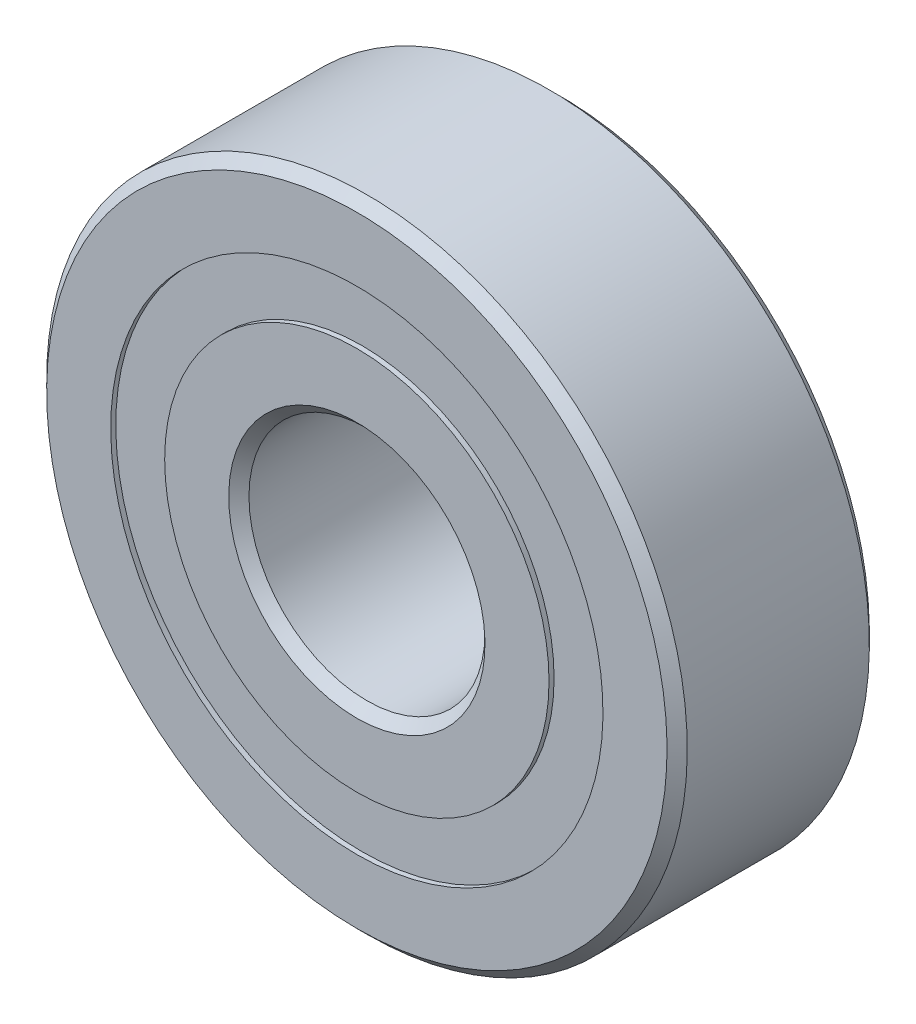
ISO-10303-21;
HEADER;
FILE_DESCRIPTION(('STEP AP214'),'2;1');
FILE_NAME('part.step','',(''),(''),'','','');
FILE_SCHEMA(('AUTOMOTIVE_DESIGN { 1 0 10303 214 1 1 1 1 }'));
ENDSEC;
DATA;
#1=APPLICATION_CONTEXT('core data for automotive mechanical design processes');
#2=APPLICATION_PROTOCOL_DEFINITION('international standard','automotive_design',2000,#1);
#3=PRODUCT_CONTEXT('',#1,'mechanical');
#4=PRODUCT('Part','Part','',(#3));
#5=PRODUCT_RELATED_PRODUCT_CATEGORY('part','',(#4));
#6=PRODUCT_DEFINITION_FORMATION('','',#4);
#7=PRODUCT_DEFINITION_CONTEXT('part definition',#1,'design');
#8=PRODUCT_DEFINITION('design','',#6,#7);
#9=PRODUCT_DEFINITION_SHAPE('','',#8);
#10=(LENGTH_UNIT() NAMED_UNIT(*) SI_UNIT(.MILLI.,.METRE.));
#11=(NAMED_UNIT(*) PLANE_ANGLE_UNIT() SI_UNIT($,.RADIAN.));
#12=(NAMED_UNIT(*) SI_UNIT($,.STERADIAN.) SOLID_ANGLE_UNIT());
#13=UNCERTAINTY_MEASURE_WITH_UNIT(LENGTH_MEASURE(1.E-05),#10,'distance_accuracy_value','');
#14=(GEOMETRIC_REPRESENTATION_CONTEXT(3) GLOBAL_UNCERTAINTY_ASSIGNED_CONTEXT((#13)) GLOBAL_UNIT_ASSIGNED_CONTEXT((#10,
#11,#12)) REPRESENTATION_CONTEXT('',''));
#15=CARTESIAN_POINT('',(0.,0.,0.));
#16=DIRECTION('',(0.,0.,1.));
#17=DIRECTION('',(1.,0.,0.));
#18=AXIS2_PLACEMENT_3D('',#15,#16,#17);
#19=CARTESIAN_POINT('',(0.,7.3,-2.85));
#20=DIRECTION('',(0.,0.,1.));
#21=DIRECTION('',(0.,-1.,0.));
#22=AXIS2_PLACEMENT_3D('',#19,#20,#21);
#23=PLANE('',#22);
#24=CARTESIAN_POINT('',(0.,0.,-2.85));
#25=DIRECTION('',(0.,0.,1.));
#26=DIRECTION('',(0.,-1.,0.));
#27=AXIS2_PLACEMENT_3D('',#24,#25,#26);
#28=CIRCLE('',#27,7.3);
#29=CARTESIAN_POINT('',(0.,-7.3,-2.85));
#30=VERTEX_POINT('',#29);
#31=EDGE_CURVE('E55',#30,#30,#28,.T.);
#32=ORIENTED_EDGE('',*,*,#31,.F.);
#33=EDGE_LOOP('',(#32));
#34=FACE_BOUND('',#33,.T.);
#35=CARTESIAN_POINT('',(0.,0.,-2.85));
#36=DIRECTION('',(0.,0.,1.));
#37=DIRECTION('',(0.,-1.,0.));
#38=AXIS2_PLACEMENT_3D('',#35,#36,#37);
#39=CIRCLE('',#38,5.7);
#40=CARTESIAN_POINT('',(0.,-5.7,-2.85));
#41=VERTEX_POINT('',#40);
#42=EDGE_CURVE('E11',#41,#41,#39,.T.);
#43=ORIENTED_EDGE('',*,*,#42,.T.);
#44=EDGE_LOOP('',(#43));
#45=FACE_BOUND('',#44,.T.);
#46=ADVANCED_FACE('F41',(#34,#45),#23,.F.);
#47=CARTESIAN_POINT('',(0.,0.,3.));
#48=DIRECTION('',(0.,0.,1.));
#49=DIRECTION('',(0.,-1.,0.));
#50=AXIS2_PLACEMENT_3D('',#47,#48,#49);
#51=CYLINDRICAL_SURFACE('',#50,5.7);
#52=ORIENTED_EDGE('',*,*,#42,.F.);
#53=EDGE_LOOP('',(#52));
#54=FACE_BOUND('',#53,.T.);
#55=CARTESIAN_POINT('',(0.,0.,-1.55492050529208));
#56=DIRECTION('',(0.,0.,1.));
#57=DIRECTION('',(0.,-1.,0.));
#58=AXIS2_PLACEMENT_3D('',#55,#56,#57);
#59=CIRCLE('',#58,5.7);
#60=CARTESIAN_POINT('',(0.,-5.7,-1.55492050529208));
#61=VERTEX_POINT('',#60);
#62=EDGE_CURVE('E47',#61,#61,#59,.T.);
#63=ORIENTED_EDGE('',*,*,#62,.T.);
#64=EDGE_LOOP('',(#63));
#65=FACE_BOUND('',#64,.T.);
#66=ADVANCED_FACE('F64',(#54,#65),#51,.F.);
#67=CARTESIAN_POINT('',(0.,7.3,-1.55492050529208));
#68=DIRECTION('',(0.,0.,-1.));
#69=DIRECTION('',(0.,1.,0.));
#70=AXIS2_PLACEMENT_3D('',#67,#68,#69);
#71=PLANE('',#70);
#72=ORIENTED_EDGE('',*,*,#62,.F.);
#73=EDGE_LOOP('',(#72));
#74=FACE_BOUND('',#73,.T.);
#75=CARTESIAN_POINT('',(0.,0.,-1.55492050529208));
#76=DIRECTION('',(0.,0.,1.));
#77=DIRECTION('',(0.,-1.,0.));
#78=AXIS2_PLACEMENT_3D('',#75,#76,#77);
#79=CIRCLE('',#78,7.3);
#80=CARTESIAN_POINT('',(0.,-7.3,-1.55492050529208));
#81=VERTEX_POINT('',#80);
#82=EDGE_CURVE('E51',#81,#81,#79,.T.);
#83=ORIENTED_EDGE('',*,*,#82,.T.);
#84=EDGE_LOOP('',(#83));
#85=FACE_BOUND('',#84,.T.);
#86=ADVANCED_FACE('F68',(#74,#85),#71,.F.);
#87=CARTESIAN_POINT('',(0.,0.,3.));
#88=DIRECTION('',(0.,0.,1.));
#89=DIRECTION('',(0.,-1.,0.));
#90=AXIS2_PLACEMENT_3D('',#87,#88,#89);
#91=CYLINDRICAL_SURFACE('',#90,7.3);
#92=ORIENTED_EDGE('',*,*,#82,.F.);
#93=EDGE_LOOP('',(#92));
#94=FACE_BOUND('',#93,.T.);
#95=ORIENTED_EDGE('',*,*,#31,.T.);
#96=EDGE_LOOP('',(#95));
#97=FACE_BOUND('',#96,.T.);
#98=ADVANCED_FACE('F61',(#94,#97),#91,.T.);
#99=CLOSED_SHELL('',(#46,#66,#86,#98));
#100=MANIFOLD_SOLID_BREP('B2',#99);
#101=CARTESIAN_POINT('',(0.,7.3,2.85));
#102=DIRECTION('',(0.,0.,-1.));
#103=DIRECTION('',(0.,1.,0.));
#104=AXIS2_PLACEMENT_3D('',#101,#102,#103);
#105=PLANE('',#104);
#106=CARTESIAN_POINT('',(0.,0.,2.85));
#107=DIRECTION('',(0.,0.,1.));
#108=DIRECTION('',(0.,-1.,0.));
#109=AXIS2_PLACEMENT_3D('',#106,#107,#108);
#110=CIRCLE('',#109,5.7);
#111=CARTESIAN_POINT('',(0.,-5.7,2.85));
#112=VERTEX_POINT('',#111);
#113=EDGE_CURVE('E40',#112,#112,#110,.T.);
#114=ORIENTED_EDGE('',*,*,#113,.F.);
#115=EDGE_LOOP('',(#114));
#116=FACE_BOUND('',#115,.T.);
#117=CARTESIAN_POINT('',(0.,0.,2.85));
#118=DIRECTION('',(0.,0.,1.));
#119=DIRECTION('',(0.,-1.,0.));
#120=AXIS2_PLACEMENT_3D('',#117,#118,#119);
#121=CIRCLE('',#120,7.3);
#122=CARTESIAN_POINT('',(0.,-7.3,2.85));
#123=VERTEX_POINT('',#122);
#124=EDGE_CURVE('E122',#123,#123,#121,.T.);
#125=ORIENTED_EDGE('',*,*,#124,.T.);
#126=EDGE_LOOP('',(#125));
#127=FACE_BOUND('',#126,.T.);
#128=ADVANCED_FACE('F108',(#116,#127),#105,.F.);
#129=CARTESIAN_POINT('',(0.,0.,3.));
#130=DIRECTION('',(0.,0.,1.));
#131=DIRECTION('',(0.,-1.,0.));
#132=AXIS2_PLACEMENT_3D('',#129,#130,#131);
#133=CYLINDRICAL_SURFACE('',#132,5.7);
#134=CARTESIAN_POINT('',(0.,0.,1.55492050529208));
#135=DIRECTION('',(0.,0.,1.));
#136=DIRECTION('',(0.,-1.,0.));
#137=AXIS2_PLACEMENT_3D('',#134,#135,#136);
#138=CIRCLE('',#137,5.7);
#139=CARTESIAN_POINT('',(0.,-5.7,1.55492050529208));
#140=VERTEX_POINT('',#139);
#141=EDGE_CURVE('E114',#140,#140,#138,.T.);
#142=ORIENTED_EDGE('',*,*,#141,.F.);
#143=EDGE_LOOP('',(#142));
#144=FACE_BOUND('',#143,.T.);
#145=ORIENTED_EDGE('',*,*,#113,.T.);
#146=EDGE_LOOP('',(#145));
#147=FACE_BOUND('',#146,.T.);
#148=ADVANCED_FACE('F137',(#144,#147),#133,.F.);
#149=CARTESIAN_POINT('',(0.,7.3,1.55492050529208));
#150=DIRECTION('',(0.,0.,1.));
#151=DIRECTION('',(0.,-1.,0.));
#152=AXIS2_PLACEMENT_3D('',#149,#150,#151);
#153=PLANE('',#152);
#154=CARTESIAN_POINT('',(0.,0.,1.55492050529208));
#155=DIRECTION('',(0.,0.,1.));
#156=DIRECTION('',(0.,-1.,0.));
#157=AXIS2_PLACEMENT_3D('',#154,#155,#156);
#158=CIRCLE('',#157,7.3);
#159=CARTESIAN_POINT('',(0.,-7.3,1.55492050529208));
#160=VERTEX_POINT('',#159);
#161=EDGE_CURVE('E118',#160,#160,#158,.T.);
#162=ORIENTED_EDGE('',*,*,#161,.F.);
#163=EDGE_LOOP('',(#162));
#164=FACE_BOUND('',#163,.T.);
#165=ORIENTED_EDGE('',*,*,#141,.T.);
#166=EDGE_LOOP('',(#165));
#167=FACE_BOUND('',#166,.T.);
#168=ADVANCED_FACE('F132',(#164,#167),#153,.F.);
#169=CARTESIAN_POINT('',(0.,0.,3.));
#170=DIRECTION('',(0.,0.,1.));
#171=DIRECTION('',(0.,-1.,0.));
#172=AXIS2_PLACEMENT_3D('',#169,#170,#171);
#173=CYLINDRICAL_SURFACE('',#172,7.3);
#174=ORIENTED_EDGE('',*,*,#124,.F.);
#175=EDGE_LOOP('',(#174));
#176=FACE_BOUND('',#175,.T.);
#177=ORIENTED_EDGE('',*,*,#161,.T.);
#178=EDGE_LOOP('',(#177));
#179=FACE_BOUND('',#178,.T.);
#180=ADVANCED_FACE('F129',(#176,#179),#173,.T.);
#181=CLOSED_SHELL('',(#128,#148,#168,#180));
#182=MANIFOLD_SOLID_BREP('B6',#181);
#183=CARTESIAN_POINT('',(-5.62916512459881,3.25000000000007,0.));
#184=DIRECTION('',(0.,0.,1.));
#185=DIRECTION('',(-0.866025403784433,0.50000000000001,0.));
#186=AXIS2_PLACEMENT_3D('',#183,#184,#185);
#187=SPHERICAL_SURFACE('',#186,1.55492050529208);
#188=CARTESIAN_POINT('',(-5.62916512459881,3.25000000000007,1.55492050529208));
#189=VERTEX_POINT('',#188);
#190=VERTEX_LOOP('',#189);
#191=FACE_BOUND('',#190,.T.);
#192=ADVANCED_FACE('F188',(#191),#187,.T.);
#193=CLOSED_SHELL('',(#192));
#194=MANIFOLD_SOLID_BREP('B35',#193);
#195=CARTESIAN_POINT('',(-5.62916512459888,-3.24999999999995,0.));
#196=DIRECTION('',(0.,0.,1.));
#197=DIRECTION('',(-0.866025403784443,-0.499999999999992,0.));
#198=AXIS2_PLACEMENT_3D('',#195,#196,#197);
#199=SPHERICAL_SURFACE('',#198,1.55492050529208);
#200=CARTESIAN_POINT('',(-5.62916512459888,-3.24999999999995,1.55492050529208));
#201=VERTEX_POINT('',#200);
#202=VERTEX_LOOP('',#201);
#203=FACE_BOUND('',#202,.T.);
#204=ADVANCED_FACE('F206',(#203),#199,.T.);
#205=CLOSED_SHELL('',(#204));
#206=MANIFOLD_SOLID_BREP('B104',#205);
#207=CARTESIAN_POINT('',(0.,-6.5,0.));
#208=DIRECTION('',(0.,0.,1.));
#209=DIRECTION('',(0.,-1.,0.));
#210=AXIS2_PLACEMENT_3D('',#207,#208,#209);
#211=SPHERICAL_SURFACE('',#210,1.55492050529208);
#212=CARTESIAN_POINT('',(0.,-6.5,1.55492050529208));
#213=VERTEX_POINT('',#212);
#214=VERTEX_LOOP('',#213);
#215=FACE_BOUND('',#214,.T.);
#216=ADVANCED_FACE('F224',(#215),#211,.T.);
#217=CLOSED_SHELL('',(#216));
#218=MANIFOLD_SOLID_BREP('B184',#217);
#219=CARTESIAN_POINT('',(5.62916512459884,-3.25000000000003,0.));
#220=DIRECTION('',(0.,0.,1.));
#221=DIRECTION('',(0.866025403784436,-0.500000000000004,0.));
#222=AXIS2_PLACEMENT_3D('',#219,#220,#221);
#223=SPHERICAL_SURFACE('',#222,1.55492050529208);
#224=CARTESIAN_POINT('',(5.62916512459884,-3.25000000000003,1.55492050529208));
#225=VERTEX_POINT('',#224);
#226=VERTEX_LOOP('',#225);
#227=FACE_BOUND('',#226,.T.);
#228=ADVANCED_FACE('F242',(#227),#223,.T.);
#229=CLOSED_SHELL('',(#228));
#230=MANIFOLD_SOLID_BREP('B202',#229);
#231=CARTESIAN_POINT('',(5.62916512459886,3.24999999999999,0.));
#232=DIRECTION('',(0.,0.,1.));
#233=DIRECTION('',(0.86602540378444,0.499999999999998,0.));
#234=AXIS2_PLACEMENT_3D('',#231,#232,#233);
#235=SPHERICAL_SURFACE('',#234,1.55492050529208);
#236=CARTESIAN_POINT('',(5.62916512459886,3.24999999999999,1.55492050529208));
#237=VERTEX_POINT('',#236);
#238=VERTEX_LOOP('',#237);
#239=FACE_BOUND('',#238,.T.);
#240=ADVANCED_FACE('F260',(#239),#235,.T.);
#241=CLOSED_SHELL('',(#240));
#242=MANIFOLD_SOLID_BREP('B220',#241);
#243=CARTESIAN_POINT('',(0.,6.5,0.));
#244=DIRECTION('',(0.,0.,1.));
#245=DIRECTION('',(0.,1.,0.));
#246=AXIS2_PLACEMENT_3D('',#243,#244,#245);
#247=SPHERICAL_SURFACE('',#246,1.55492050529208);
#248=CARTESIAN_POINT('',(0.,6.5,1.55492050529208));
#249=VERTEX_POINT('',#248);
#250=VERTEX_LOOP('',#249);
#251=FACE_BOUND('',#250,.T.);
#252=ADVANCED_FACE('F280',(#251),#247,.T.);
#253=CLOSED_SHELL('',(#252));
#254=MANIFOLD_SOLID_BREP('B238',#253);
#255=CARTESIAN_POINT('',(0.,3.8,3.));
#256=DIRECTION('',(0.,0.,-1.));
#257=DIRECTION('',(0.,1.,0.));
#258=AXIS2_PLACEMENT_3D('',#255,#256,#257);
#259=PLANE('',#258);
#260=CARTESIAN_POINT('',(0.,0.,3.));
#261=DIRECTION('',(0.,0.,1.));
#262=DIRECTION('',(0.,-1.,0.));
#263=AXIS2_PLACEMENT_3D('',#260,#261,#262);
#264=CIRCLE('',#263,3.8);
#265=CARTESIAN_POINT('',(0.,-3.8,3.));
#266=VERTEX_POINT('',#265);
#267=EDGE_CURVE('E327',#266,#266,#264,.T.);
#268=ORIENTED_EDGE('',*,*,#267,.F.);
#269=EDGE_LOOP('',(#268));
#270=FACE_BOUND('',#269,.T.);
#271=CARTESIAN_POINT('',(0.,0.,3.));
#272=DIRECTION('',(0.,0.,1.));
#273=DIRECTION('',(0.,-1.,0.));
#274=AXIS2_PLACEMENT_3D('',#271,#272,#273);
#275=CIRCLE('',#274,5.7);
#276=CARTESIAN_POINT('',(0.,-5.7,3.));
#277=VERTEX_POINT('',#276);
#278=EDGE_CURVE('E279',#277,#277,#275,.T.);
#279=ORIENTED_EDGE('',*,*,#278,.T.);
#280=EDGE_LOOP('',(#279));
#281=FACE_BOUND('',#280,.T.);
#282=ADVANCED_FACE('F299',(#270,#281),#259,.F.);
#283=CARTESIAN_POINT('',(0.,0.,3.));
#284=DIRECTION('',(0.,0.,1.));
#285=DIRECTION('',(0.,-1.,0.));
#286=AXIS2_PLACEMENT_3D('',#283,#284,#285);
#287=CYLINDRICAL_SURFACE('',#286,5.7);
#288=ORIENTED_EDGE('',*,*,#278,.F.);
#289=EDGE_LOOP('',(#288));
#290=FACE_BOUND('',#289,.T.);
#291=CARTESIAN_POINT('',(0.,0.,1.33333333333333));
#292=DIRECTION('',(0.,0.,1.));
#293=DIRECTION('',(0.,-1.,0.));
#294=AXIS2_PLACEMENT_3D('',#291,#292,#293);
#295=CIRCLE('',#294,5.7);
#296=CARTESIAN_POINT('',(0.,-5.7,1.33333333333333));
#297=VERTEX_POINT('',#296);
#298=EDGE_CURVE('E305',#297,#297,#295,.T.);
#299=ORIENTED_EDGE('',*,*,#298,.T.);
#300=EDGE_LOOP('',(#299));
#301=FACE_BOUND('',#300,.T.);
#302=ADVANCED_FACE('F334',(#290,#301),#287,.T.);
#303=CARTESIAN_POINT('',(0.,0.,0.));
#304=DIRECTION('',(0.,0.,1.));
#305=DIRECTION('',(0.,-1.,0.));
#306=AXIS2_PLACEMENT_3D('',#303,#304,#305);
#307=TOROIDAL_SURFACE('',#306,6.5,1.55492050529208);
#308=ORIENTED_EDGE('',*,*,#298,.F.);
#309=EDGE_LOOP('',(#308));
#310=FACE_BOUND('',#309,.T.);
#311=CARTESIAN_POINT('',(0.,0.,-1.33333333333333));
#312=DIRECTION('',(0.,0.,1.));
#313=DIRECTION('',(0.,-1.,0.));
#314=AXIS2_PLACEMENT_3D('',#311,#312,#313);
#315=CIRCLE('',#314,5.7);
#316=CARTESIAN_POINT('',(0.,-5.7,-1.33333333333333));
#317=VERTEX_POINT('',#316);
#318=EDGE_CURVE('E309',#317,#317,#315,.T.);
#319=ORIENTED_EDGE('',*,*,#318,.T.);
#320=EDGE_LOOP('',(#319));
#321=FACE_BOUND('',#320,.T.);
#322=ADVANCED_FACE('F338',(#310,#321),#307,.F.);
#323=CARTESIAN_POINT('',(0.,0.,3.));
#324=DIRECTION('',(0.,0.,1.));
#325=DIRECTION('',(0.,-1.,0.));
#326=AXIS2_PLACEMENT_3D('',#323,#324,#325);
#327=CYLINDRICAL_SURFACE('',#326,5.7);
#328=ORIENTED_EDGE('',*,*,#318,.F.);
#329=EDGE_LOOP('',(#328));
#330=FACE_BOUND('',#329,.T.);
#331=CARTESIAN_POINT('',(0.,0.,-3.00000000000001));
#332=DIRECTION('',(0.,0.,1.));
#333=DIRECTION('',(0.,-1.,0.));
#334=AXIS2_PLACEMENT_3D('',#331,#332,#333);
#335=CIRCLE('',#334,5.7);
#336=CARTESIAN_POINT('',(0.,-5.7,-3.00000000000001));
#337=VERTEX_POINT('',#336);
#338=EDGE_CURVE('E313',#337,#337,#335,.T.);
#339=ORIENTED_EDGE('',*,*,#338,.T.);
#340=EDGE_LOOP('',(#339));
#341=FACE_BOUND('',#340,.T.);
#342=ADVANCED_FACE('F343',(#330,#341),#327,.T.);
#343=CARTESIAN_POINT('',(0.,3.8,-3.));
#344=DIRECTION('',(0.,0.,1.));
#345=DIRECTION('',(0.,-1.,0.));
#346=AXIS2_PLACEMENT_3D('',#343,#344,#345);
#347=PLANE('',#346);
#348=ORIENTED_EDGE('',*,*,#338,.F.);
#349=EDGE_LOOP('',(#348));
#350=FACE_BOUND('',#349,.T.);
#351=CARTESIAN_POINT('',(0.,0.,-3.00000000000001));
#352=DIRECTION('',(0.,0.,1.));
#353=DIRECTION('',(0.,-1.,0.));
#354=AXIS2_PLACEMENT_3D('',#351,#352,#353);
#355=CIRCLE('',#354,3.8);
#356=CARTESIAN_POINT('',(0.,-3.79999999999999,-3.00000000000001));
#357=VERTEX_POINT('',#356);
#358=EDGE_CURVE('E318',#357,#357,#355,.T.);
#359=ORIENTED_EDGE('',*,*,#358,.T.);
#360=EDGE_LOOP('',(#359));
#361=FACE_BOUND('',#360,.T.);
#362=ADVANCED_FACE('F349',(#350,#361),#347,.F.);
#363=CARTESIAN_POINT('',(0.,0.,-2.7));
#364=DIRECTION('',(0.,0.,-1.));
#365=DIRECTION('',(0.,1.,0.));
#366=AXIS2_PLACEMENT_3D('',#363,#364,#365);
#367=CONICAL_SURFACE('',#366,3.5,0.785398163397437);
#368=ORIENTED_EDGE('',*,*,#358,.F.);
#369=EDGE_LOOP('',(#368));
#370=FACE_BOUND('',#369,.T.);
#371=CARTESIAN_POINT('',(0.,0.,-2.7));
#372=DIRECTION('',(0.,0.,1.));
#373=DIRECTION('',(0.,-1.,0.));
#374=AXIS2_PLACEMENT_3D('',#371,#372,#373);
#375=CIRCLE('',#374,3.5);
#376=CARTESIAN_POINT('',(0.,-3.5,-2.7));
#377=VERTEX_POINT('',#376);
#378=EDGE_CURVE('E321',#377,#377,#375,.T.);
#379=ORIENTED_EDGE('',*,*,#378,.T.);
#380=EDGE_LOOP('',(#379));
#381=FACE_BOUND('',#380,.T.);
#382=ADVANCED_FACE('F353',(#370,#381),#367,.F.);
#383=CARTESIAN_POINT('',(0.,0.,3.));
#384=DIRECTION('',(0.,0.,1.));
#385=DIRECTION('',(0.,-1.,0.));
#386=AXIS2_PLACEMENT_3D('',#383,#384,#385);
#387=CYLINDRICAL_SURFACE('',#386,3.5);
#388=ORIENTED_EDGE('',*,*,#378,.F.);
#389=EDGE_LOOP('',(#388));
#390=FACE_BOUND('',#389,.T.);
#391=CARTESIAN_POINT('',(0.,0.,2.7));
#392=DIRECTION('',(0.,0.,1.));
#393=DIRECTION('',(0.,-1.,0.));
#394=AXIS2_PLACEMENT_3D('',#391,#392,#393);
#395=CIRCLE('',#394,3.5);
#396=CARTESIAN_POINT('',(0.,-3.5,2.7));
#397=VERTEX_POINT('',#396);
#398=EDGE_CURVE('E324',#397,#397,#395,.T.);
#399=ORIENTED_EDGE('',*,*,#398,.T.);
#400=EDGE_LOOP('',(#399));
#401=FACE_BOUND('',#400,.T.);
#402=ADVANCED_FACE('F357',(#390,#401),#387,.F.);
#403=CARTESIAN_POINT('',(0.,0.,3.));
#404=DIRECTION('',(0.,0.,1.));
#405=DIRECTION('',(0.,-1.,0.));
#406=AXIS2_PLACEMENT_3D('',#403,#404,#405);
#407=CONICAL_SURFACE('',#406,3.8,0.785398163397438);
#408=ORIENTED_EDGE('',*,*,#398,.F.);
#409=EDGE_LOOP('',(#408));
#410=FACE_BOUND('',#409,.T.);
#411=ORIENTED_EDGE('',*,*,#267,.T.);
#412=EDGE_LOOP('',(#411));
#413=FACE_BOUND('',#412,.T.);
#414=ADVANCED_FACE('F331',(#410,#413),#407,.F.);
#415=CLOSED_SHELL('',(#282,#302,#322,#342,#362,#382,#402,#414));
#416=MANIFOLD_SOLID_BREP('B256',#415);
#417=CARTESIAN_POINT('',(0.,0.,3.));
#418=DIRECTION('',(0.,0.,1.));
#419=DIRECTION('',(0.,-1.,0.));
#420=AXIS2_PLACEMENT_3D('',#417,#418,#419);
#421=CYLINDRICAL_SURFACE('',#420,9.5);
#422=CARTESIAN_POINT('',(0.,0.,2.7));
#423=DIRECTION('',(0.,0.,1.));
#424=DIRECTION('',(0.,-1.,0.));
#425=AXIS2_PLACEMENT_3D('',#422,#423,#424);
#426=CIRCLE('',#425,9.5);
#427=CARTESIAN_POINT('',(0.,-9.5,2.7));
#428=VERTEX_POINT('',#427);
#429=EDGE_CURVE('E298',#428,#428,#426,.T.);
#430=ORIENTED_EDGE('',*,*,#429,.F.);
#431=EDGE_LOOP('',(#430));
#432=FACE_BOUND('',#431,.T.);
#433=CARTESIAN_POINT('',(0.,0.,-2.7));
#434=DIRECTION('',(0.,0.,1.));
#435=DIRECTION('',(0.,-1.,0.));
#436=AXIS2_PLACEMENT_3D('',#433,#434,#435);
#437=CIRCLE('',#436,9.5);
#438=CARTESIAN_POINT('',(0.,-9.5,-2.7));
#439=VERTEX_POINT('',#438);
#440=EDGE_CURVE('E448',#439,#439,#437,.T.);
#441=ORIENTED_EDGE('',*,*,#440,.T.);
#442=EDGE_LOOP('',(#441));
#443=FACE_BOUND('',#442,.T.);
#444=ADVANCED_FACE('F420',(#432,#443),#421,.T.);
#445=CARTESIAN_POINT('',(0.,0.,2.7));
#446=DIRECTION('',(0.,0.,-1.));
#447=DIRECTION('',(0.,1.,0.));
#448=AXIS2_PLACEMENT_3D('',#445,#446,#447);
#449=CONICAL_SURFACE('',#448,9.5,0.785398163397448);
#450=CARTESIAN_POINT('',(0.,0.,3.));
#451=DIRECTION('',(0.,0.,1.));
#452=DIRECTION('',(0.,-1.,0.));
#453=AXIS2_PLACEMENT_3D('',#450,#451,#452);
#454=CIRCLE('',#453,9.2);
#455=CARTESIAN_POINT('',(0.,-9.2,3.));
#456=VERTEX_POINT('',#455);
#457=EDGE_CURVE('E426',#456,#456,#454,.T.);
#458=ORIENTED_EDGE('',*,*,#457,.F.);
#459=EDGE_LOOP('',(#458));
#460=FACE_BOUND('',#459,.T.);
#461=ORIENTED_EDGE('',*,*,#429,.T.);
#462=EDGE_LOOP('',(#461));
#463=FACE_BOUND('',#462,.T.);
#464=ADVANCED_FACE('F485',(#460,#463),#449,.T.);
#465=CARTESIAN_POINT('',(0.,9.2,3.));
#466=DIRECTION('',(0.,0.,-1.));
#467=DIRECTION('',(0.,1.,0.));
#468=AXIS2_PLACEMENT_3D('',#465,#466,#467);
#469=PLANE('',#468);
#470=CARTESIAN_POINT('',(0.,0.,3.));
#471=DIRECTION('',(0.,0.,1.));
#472=DIRECTION('',(0.,-1.,0.));
#473=AXIS2_PLACEMENT_3D('',#470,#471,#472);
#474=CIRCLE('',#473,7.3);
#475=CARTESIAN_POINT('',(0.,-7.3,3.));
#476=VERTEX_POINT('',#475);
#477=EDGE_CURVE('E430',#476,#476,#474,.T.);
#478=ORIENTED_EDGE('',*,*,#477,.F.);
#479=EDGE_LOOP('',(#478));
#480=FACE_BOUND('',#479,.T.);
#481=ORIENTED_EDGE('',*,*,#457,.T.);
#482=EDGE_LOOP('',(#481));
#483=FACE_BOUND('',#482,.T.);
#484=ADVANCED_FACE('F480',(#480,#483),#469,.F.);
#485=CARTESIAN_POINT('',(0.,0.,3.));
#486=DIRECTION('',(0.,0.,1.));
#487=DIRECTION('',(0.,-1.,0.));
#488=AXIS2_PLACEMENT_3D('',#485,#486,#487);
#489=CYLINDRICAL_SURFACE('',#488,7.3);
#490=CARTESIAN_POINT('',(0.,0.,1.33333333333333));
#491=DIRECTION('',(0.,0.,1.));
#492=DIRECTION('',(0.,-1.,0.));
#493=AXIS2_PLACEMENT_3D('',#490,#491,#492);
#494=CIRCLE('',#493,7.3);
#495=CARTESIAN_POINT('',(0.,-7.3,1.33333333333333));
#496=VERTEX_POINT('',#495);
#497=EDGE_CURVE('E434',#496,#496,#494,.T.);
#498=ORIENTED_EDGE('',*,*,#497,.F.);
#499=EDGE_LOOP('',(#498));
#500=FACE_BOUND('',#499,.T.);
#501=ORIENTED_EDGE('',*,*,#477,.T.);
#502=EDGE_LOOP('',(#501));
#503=FACE_BOUND('',#502,.T.);
#504=ADVANCED_FACE('F474',(#500,#503),#489,.F.);
#505=CARTESIAN_POINT('',(0.,0.,0.));
#506=DIRECTION('',(0.,0.,1.));
#507=DIRECTION('',(0.,-1.,0.));
#508=AXIS2_PLACEMENT_3D('',#505,#506,#507);
#509=TOROIDAL_SURFACE('',#508,6.5,1.55492050529208);
#510=CARTESIAN_POINT('',(0.,0.,-1.33333333333334));
#511=DIRECTION('',(0.,0.,1.));
#512=DIRECTION('',(0.,-1.,0.));
#513=AXIS2_PLACEMENT_3D('',#510,#511,#512);
#514=CIRCLE('',#513,7.3);
#515=CARTESIAN_POINT('',(0.,-7.3,-1.33333333333334));
#516=VERTEX_POINT('',#515);
#517=EDGE_CURVE('E439',#516,#516,#514,.T.);
#518=ORIENTED_EDGE('',*,*,#517,.F.);
#519=EDGE_LOOP('',(#518));
#520=FACE_BOUND('',#519,.T.);
#521=ORIENTED_EDGE('',*,*,#497,.T.);
#522=EDGE_LOOP('',(#521));
#523=FACE_BOUND('',#522,.T.);
#524=ADVANCED_FACE('F468',(#520,#523),#509,.F.);
#525=CARTESIAN_POINT('',(0.,0.,3.));
#526=DIRECTION('',(0.,0.,1.));
#527=DIRECTION('',(0.,-1.,0.));
#528=AXIS2_PLACEMENT_3D('',#525,#526,#527);
#529=CYLINDRICAL_SURFACE('',#528,7.3);
#530=CARTESIAN_POINT('',(0.,0.,-3.));
#531=DIRECTION('',(0.,0.,1.));
#532=DIRECTION('',(0.,-1.,0.));
#533=AXIS2_PLACEMENT_3D('',#530,#531,#532);
#534=CIRCLE('',#533,7.3);
#535=CARTESIAN_POINT('',(0.,-7.3,-3.));
#536=VERTEX_POINT('',#535);
#537=EDGE_CURVE('E442',#536,#536,#534,.T.);
#538=ORIENTED_EDGE('',*,*,#537,.F.);
#539=EDGE_LOOP('',(#538));
#540=FACE_BOUND('',#539,.T.);
#541=ORIENTED_EDGE('',*,*,#517,.T.);
#542=EDGE_LOOP('',(#541));
#543=FACE_BOUND('',#542,.T.);
#544=ADVANCED_FACE('F462',(#540,#543),#529,.F.);
#545=CARTESIAN_POINT('',(0.,9.2,-3.));
#546=DIRECTION('',(0.,0.,1.));
#547=DIRECTION('',(0.,-1.,0.));
#548=AXIS2_PLACEMENT_3D('',#545,#546,#547);
#549=PLANE('',#548);
#550=CARTESIAN_POINT('',(0.,0.,-3.));
#551=DIRECTION('',(0.,0.,1.));
#552=DIRECTION('',(0.,-1.,0.));
#553=AXIS2_PLACEMENT_3D('',#550,#551,#552);
#554=CIRCLE('',#553,9.2);
#555=CARTESIAN_POINT('',(0.,-9.2,-3.));
#556=VERTEX_POINT('',#555);
#557=EDGE_CURVE('E445',#556,#556,#554,.T.);
#558=ORIENTED_EDGE('',*,*,#557,.F.);
#559=EDGE_LOOP('',(#558));
#560=FACE_BOUND('',#559,.T.);
#561=ORIENTED_EDGE('',*,*,#537,.T.);
#562=EDGE_LOOP('',(#561));
#563=FACE_BOUND('',#562,.T.);
#564=ADVANCED_FACE('F456',(#560,#563),#549,.F.);
#565=CARTESIAN_POINT('',(0.,0.,-3.));
#566=DIRECTION('',(0.,0.,1.));
#567=DIRECTION('',(0.,-1.,0.));
#568=AXIS2_PLACEMENT_3D('',#565,#566,#567);
#569=CONICAL_SURFACE('',#568,9.2,0.785398163397448);
#570=ORIENTED_EDGE('',*,*,#440,.F.);
#571=EDGE_LOOP('',(#570));
#572=FACE_BOUND('',#571,.T.);
#573=ORIENTED_EDGE('',*,*,#557,.T.);
#574=EDGE_LOOP('',(#573));
#575=FACE_BOUND('',#574,.T.);
#576=ADVANCED_FACE('F453',(#572,#575),#569,.T.);
#577=CLOSED_SHELL('',(#444,#464,#484,#504,#524,#544,#564,#576));
#578=MANIFOLD_SOLID_BREP('B274',#577);
#579=ADVANCED_BREP_SHAPE_REPRESENTATION('',(#18,#100,#182,#194,#206,#218,#230,#242,#254,#416,
#578),#14);
#580=SHAPE_DEFINITION_REPRESENTATION(#9,#579);
ENDSEC;
END-ISO-10303-21;
